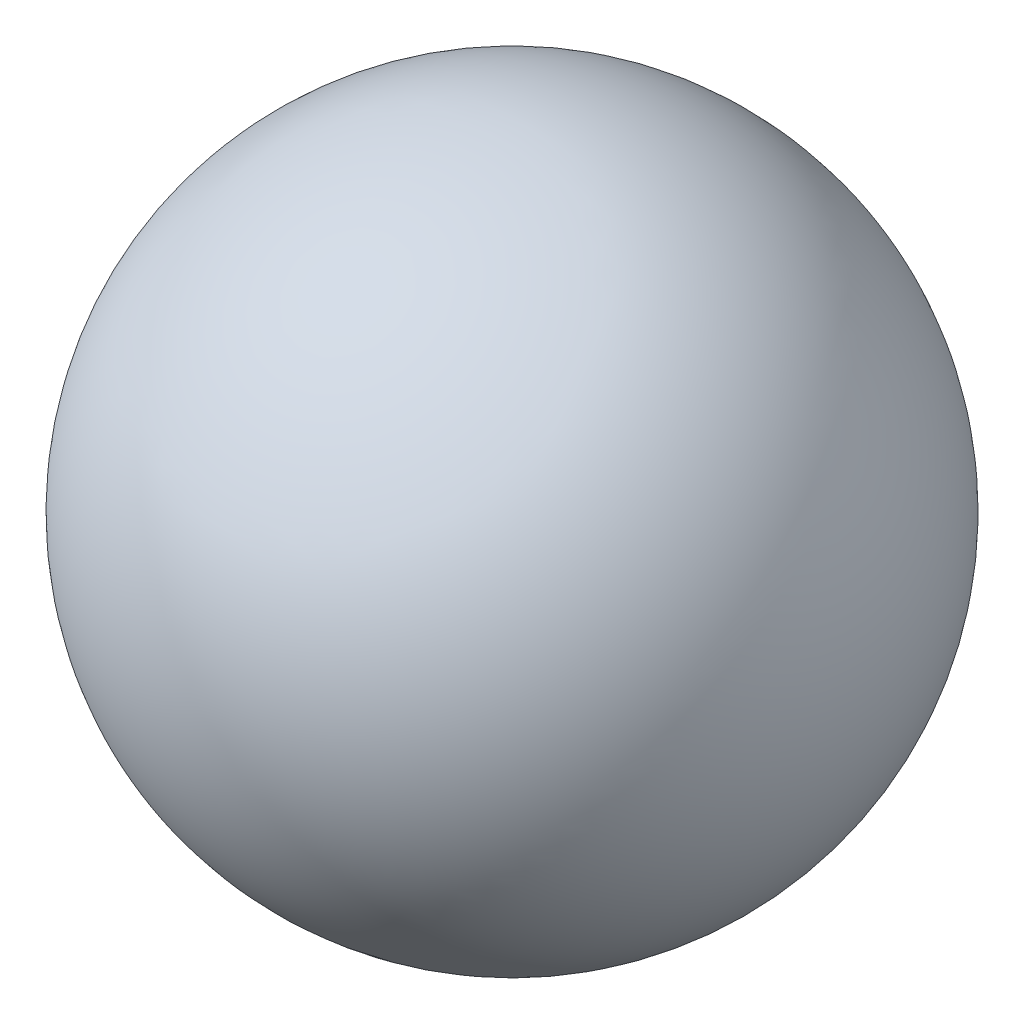
ISO-10303-21;
HEADER;
FILE_DESCRIPTION(('STEP AP214'),'2;1');
FILE_NAME('part.step','',(''),(''),'','','');
FILE_SCHEMA(('AUTOMOTIVE_DESIGN { 1 0 10303 214 1 1 1 1 }'));
ENDSEC;
DATA;
#1=APPLICATION_CONTEXT('core data for automotive mechanical design processes');
#2=APPLICATION_PROTOCOL_DEFINITION('international standard','automotive_design',2000,#1);
#3=PRODUCT_CONTEXT('',#1,'mechanical');
#4=PRODUCT('Part','Part','',(#3));
#5=PRODUCT_RELATED_PRODUCT_CATEGORY('part','',(#4));
#6=PRODUCT_DEFINITION_FORMATION('','',#4);
#7=PRODUCT_DEFINITION_CONTEXT('part definition',#1,'design');
#8=PRODUCT_DEFINITION('design','',#6,#7);
#9=PRODUCT_DEFINITION_SHAPE('','',#8);
#10=(LENGTH_UNIT() NAMED_UNIT(*) SI_UNIT(.MILLI.,.METRE.));
#11=(NAMED_UNIT(*) PLANE_ANGLE_UNIT() SI_UNIT($,.RADIAN.));
#12=(NAMED_UNIT(*) SI_UNIT($,.STERADIAN.) SOLID_ANGLE_UNIT());
#13=UNCERTAINTY_MEASURE_WITH_UNIT(LENGTH_MEASURE(1.E-05),#10,'distance_accuracy_value','');
#14=(GEOMETRIC_REPRESENTATION_CONTEXT(3) GLOBAL_UNCERTAINTY_ASSIGNED_CONTEXT((#13)) GLOBAL_UNIT_ASSIGNED_CONTEXT((#10,
#11,#12)) REPRESENTATION_CONTEXT('',''));
#15=CARTESIAN_POINT('',(0.,0.,0.));
#16=DIRECTION('',(0.,0.,1.));
#17=DIRECTION('',(1.,0.,0.));
#18=AXIS2_PLACEMENT_3D('',#15,#16,#17);
#19=CARTESIAN_POINT('',(64.16,-10.0471246789676,68.6517004500641));
#20=DIRECTION('',(0.,-0.144806720363313,0.989459960654111));
#21=DIRECTION('',(0.173648177666934,-0.974427840547315,-0.14260678090206));
#22=AXIS2_PLACEMENT_3D('',#19,#20,#21);
#23=SPHERICAL_SURFACE('',#22,7.15);
#24=CARTESIAN_POINT('',(64.16,-9.01175662836995,61.5770617313872));
#25=VERTEX_POINT('',#24);
#26=VERTEX_LOOP('',#25);
#27=FACE_BOUND('',#26,.T.);
#28=CARTESIAN_POINT('',(64.16,-11.0824927295653,75.7263391687409));
#29=VERTEX_POINT('',#28);
#30=VERTEX_LOOP('',#29);
#31=FACE_BOUND('',#30,.T.);
#32=ADVANCED_FACE('F19',(#27,#31),#23,.T.);
#33=CLOSED_SHELL('',(#32));
#34=MANIFOLD_SOLID_BREP('B1',#33);
#35=ADVANCED_BREP_SHAPE_REPRESENTATION('',(#18,#34),#14);
#36=SHAPE_DEFINITION_REPRESENTATION(#9,#35);
ENDSEC;
END-ISO-10303-21;
